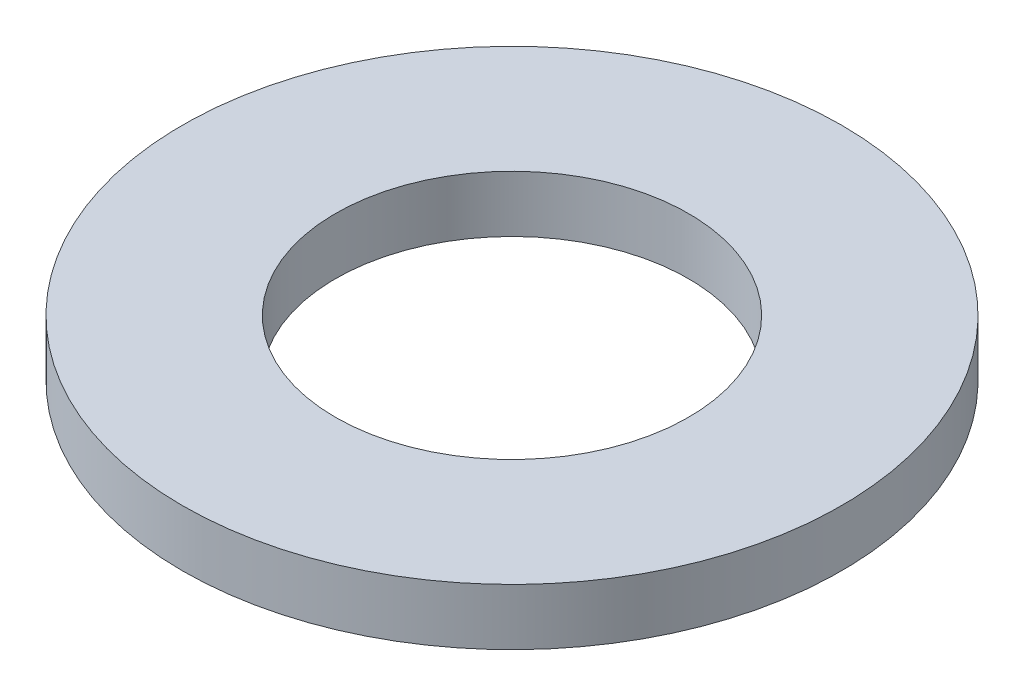
ISO-10303-21;
HEADER;
FILE_DESCRIPTION(('STEP AP214'),'2;1');
FILE_NAME('part.step','',(''),(''),'','','');
FILE_SCHEMA(('AUTOMOTIVE_DESIGN { 1 0 10303 214 1 1 1 1 }'));
ENDSEC;
DATA;
#1=APPLICATION_CONTEXT('core data for automotive mechanical design processes');
#2=APPLICATION_PROTOCOL_DEFINITION('international standard','automotive_design',2000,#1);
#3=PRODUCT_CONTEXT('',#1,'mechanical');
#4=PRODUCT('Part','Part','',(#3));
#5=PRODUCT_RELATED_PRODUCT_CATEGORY('part','',(#4));
#6=PRODUCT_DEFINITION_FORMATION('','',#4);
#7=PRODUCT_DEFINITION_CONTEXT('part definition',#1,'design');
#8=PRODUCT_DEFINITION('design','',#6,#7);
#9=PRODUCT_DEFINITION_SHAPE('','',#8);
#10=(LENGTH_UNIT() NAMED_UNIT(*) SI_UNIT(.MILLI.,.METRE.));
#11=(NAMED_UNIT(*) PLANE_ANGLE_UNIT() SI_UNIT($,.RADIAN.));
#12=(NAMED_UNIT(*) SI_UNIT($,.STERADIAN.) SOLID_ANGLE_UNIT());
#13=UNCERTAINTY_MEASURE_WITH_UNIT(LENGTH_MEASURE(1.E-05),#10,'distance_accuracy_value','');
#14=(GEOMETRIC_REPRESENTATION_CONTEXT(3) GLOBAL_UNCERTAINTY_ASSIGNED_CONTEXT((#13)) GLOBAL_UNIT_ASSIGNED_CONTEXT((#10,
#11,#12)) REPRESENTATION_CONTEXT('',''));
#15=CARTESIAN_POINT('',(0.,0.,0.));
#16=DIRECTION('',(0.,0.,1.));
#17=DIRECTION('',(1.,0.,0.));
#18=AXIS2_PLACEMENT_3D('',#15,#16,#17);
#19=CARTESIAN_POINT('',(0.,12.,0.));
#20=DIRECTION('',(0.,-1.,0.));
#21=DIRECTION('',(0.,0.,-1.));
#22=AXIS2_PLACEMENT_3D('',#19,#20,#21);
#23=CYLINDRICAL_SURFACE('',#22,70.);
#24=CARTESIAN_POINT('',(0.,12.,0.));
#25=DIRECTION('',(0.,1.,0.));
#26=DIRECTION('',(0.,0.,1.));
#27=AXIS2_PLACEMENT_3D('',#24,#25,#26);
#28=CIRCLE('',#27,70.);
#29=CARTESIAN_POINT('',(0.,12.,70.));
#30=VERTEX_POINT('',#29);
#31=EDGE_CURVE('E10',#30,#30,#28,.T.);
#32=ORIENTED_EDGE('',*,*,#31,.F.);
#33=EDGE_LOOP('',(#32));
#34=FACE_BOUND('',#33,.T.);
#35=CARTESIAN_POINT('',(0.,0.,0.));
#36=DIRECTION('',(0.,1.,0.));
#37=DIRECTION('',(0.,0.,1.));
#38=AXIS2_PLACEMENT_3D('',#35,#36,#37);
#39=CIRCLE('',#38,70.);
#40=CARTESIAN_POINT('',(0.,0.,70.));
#41=VERTEX_POINT('',#40);
#42=EDGE_CURVE('E37',#41,#41,#39,.T.);
#43=ORIENTED_EDGE('',*,*,#42,.T.);
#44=EDGE_LOOP('',(#43));
#45=FACE_BOUND('',#44,.T.);
#46=ADVANCED_FACE('F40',(#34,#45),#23,.T.);
#47=CARTESIAN_POINT('',(0.,12.,0.));
#48=DIRECTION('',(0.,1.,0.));
#49=DIRECTION('',(0.,0.,1.));
#50=AXIS2_PLACEMENT_3D('',#47,#48,#49);
#51=PLANE('',#50);
#52=CARTESIAN_POINT('',(0.,12.,0.));
#53=DIRECTION('',(0.,1.,0.));
#54=DIRECTION('',(0.,0.,1.));
#55=AXIS2_PLACEMENT_3D('',#52,#53,#54);
#56=CIRCLE('',#55,37.5);
#57=CARTESIAN_POINT('',(0.,12.,37.5));
#58=VERTEX_POINT('',#57);
#59=EDGE_CURVE('E50',#58,#58,#56,.T.);
#60=ORIENTED_EDGE('',*,*,#59,.F.);
#61=EDGE_LOOP('',(#60));
#62=FACE_BOUND('',#61,.T.);
#63=ORIENTED_EDGE('',*,*,#31,.T.);
#64=EDGE_LOOP('',(#63));
#65=FACE_BOUND('',#64,.T.);
#66=ADVANCED_FACE('F59',(#62,#65),#51,.T.);
#67=CARTESIAN_POINT('',(0.,0.,0.));
#68=DIRECTION('',(0.,1.,0.));
#69=DIRECTION('',(0.,0.,1.));
#70=AXIS2_PLACEMENT_3D('',#67,#68,#69);
#71=PLANE('',#70);
#72=CARTESIAN_POINT('',(0.,0.,0.));
#73=DIRECTION('',(0.,1.,0.));
#74=DIRECTION('',(0.,0.,1.));
#75=AXIS2_PLACEMENT_3D('',#72,#73,#74);
#76=CIRCLE('',#75,37.5);
#77=CARTESIAN_POINT('',(0.,0.,37.5));
#78=VERTEX_POINT('',#77);
#79=EDGE_CURVE('E47',#78,#78,#76,.T.);
#80=ORIENTED_EDGE('',*,*,#79,.T.);
#81=EDGE_LOOP('',(#80));
#82=FACE_BOUND('',#81,.T.);
#83=ORIENTED_EDGE('',*,*,#42,.F.);
#84=EDGE_LOOP('',(#83));
#85=FACE_BOUND('',#84,.T.);
#86=ADVANCED_FACE('F58',(#82,#85),#71,.F.);
#87=CARTESIAN_POINT('',(0.,12.,0.));
#88=DIRECTION('',(0.,-1.,0.));
#89=DIRECTION('',(0.,0.,-1.));
#90=AXIS2_PLACEMENT_3D('',#87,#88,#89);
#91=CYLINDRICAL_SURFACE('',#90,37.5);
#92=ORIENTED_EDGE('',*,*,#59,.T.);
#93=EDGE_LOOP('',(#92));
#94=FACE_BOUND('',#93,.T.);
#95=ORIENTED_EDGE('',*,*,#79,.F.);
#96=EDGE_LOOP('',(#95));
#97=FACE_BOUND('',#96,.T.);
#98=ADVANCED_FACE('F54',(#94,#97),#91,.F.);
#99=CLOSED_SHELL('',(#46,#66,#86,#98));
#100=MANIFOLD_SOLID_BREP('B2',#99);
#101=ADVANCED_BREP_SHAPE_REPRESENTATION('',(#18,#100),#14);
#102=SHAPE_DEFINITION_REPRESENTATION(#9,#101);
ENDSEC;
END-ISO-10303-21;
